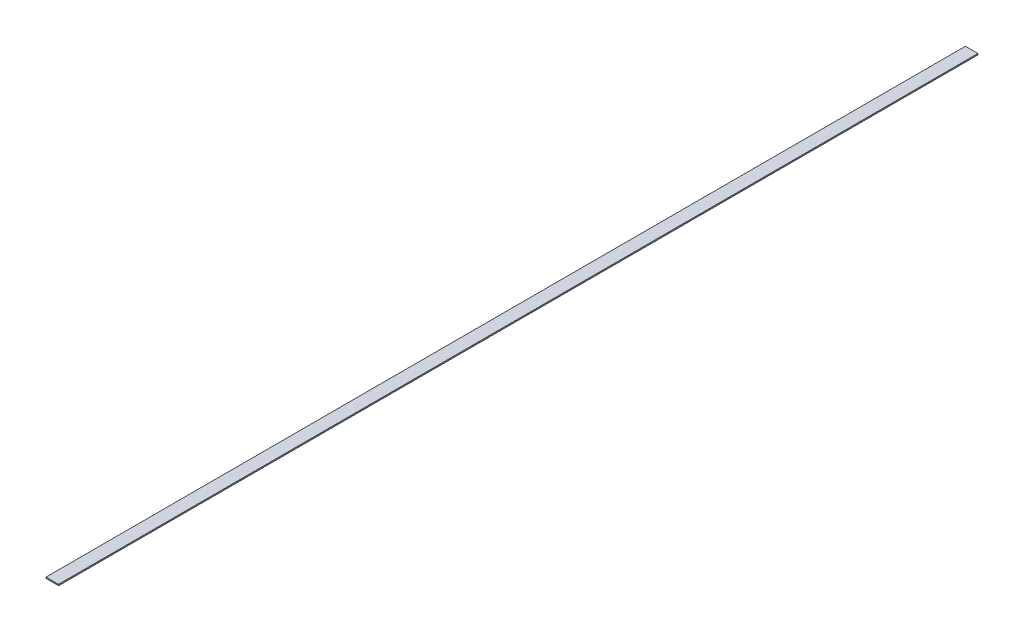
ISO-10303-21;
HEADER;
FILE_DESCRIPTION(('STEP AP214'),'2;1');
FILE_NAME('part.step','',(''),(''),'','','');
FILE_SCHEMA(('AUTOMOTIVE_DESIGN { 1 0 10303 214 1 1 1 1 }'));
ENDSEC;
DATA;
#1=APPLICATION_CONTEXT('core data for automotive mechanical design processes');
#2=APPLICATION_PROTOCOL_DEFINITION('international standard','automotive_design',2000,#1);
#3=PRODUCT_CONTEXT('',#1,'mechanical');
#4=PRODUCT('Part','Part','',(#3));
#5=PRODUCT_RELATED_PRODUCT_CATEGORY('part','',(#4));
#6=PRODUCT_DEFINITION_FORMATION('','',#4);
#7=PRODUCT_DEFINITION_CONTEXT('part definition',#1,'design');
#8=PRODUCT_DEFINITION('design','',#6,#7);
#9=PRODUCT_DEFINITION_SHAPE('','',#8);
#10=(LENGTH_UNIT() NAMED_UNIT(*) SI_UNIT(.MILLI.,.METRE.));
#11=(NAMED_UNIT(*) PLANE_ANGLE_UNIT() SI_UNIT($,.RADIAN.));
#12=(NAMED_UNIT(*) SI_UNIT($,.STERADIAN.) SOLID_ANGLE_UNIT());
#13=UNCERTAINTY_MEASURE_WITH_UNIT(LENGTH_MEASURE(1.E-05),#10,'distance_accuracy_value','');
#14=(GEOMETRIC_REPRESENTATION_CONTEXT(3) GLOBAL_UNCERTAINTY_ASSIGNED_CONTEXT((#13)) GLOBAL_UNIT_ASSIGNED_CONTEXT((#10,
#11,#12)) REPRESENTATION_CONTEXT('',''));
#15=CARTESIAN_POINT('',(0.,0.,0.));
#16=DIRECTION('',(0.,0.,1.));
#17=DIRECTION('',(1.,0.,0.));
#18=AXIS2_PLACEMENT_3D('',#15,#16,#17);
#19=CARTESIAN_POINT('',(-50.7999999999998,5.08,0.));
#20=DIRECTION('',(0.,0.,-1.));
#21=DIRECTION('',(-1.,0.,0.));
#22=AXIS2_PLACEMENT_3D('',#19,#20,#21);
#23=PLANE('',#22);
#24=DIRECTION('',(1.,0.,0.));
#25=VECTOR('',#24,1.);
#26=CARTESIAN_POINT('',(-50.7999999999998,0.,0.));
#27=LINE('',#26,#25);
#28=CARTESIAN_POINT('',(-50.7999999999998,0.,0.));
#29=VERTEX_POINT('',#28);
#30=CARTESIAN_POINT('',(0.,0.,0.));
#31=VERTEX_POINT('',#30);
#32=EDGE_CURVE('E110',#29,#31,#27,.T.);
#33=ORIENTED_EDGE('',*,*,#32,.T.);
#34=DIRECTION('',(0.,-1.,0.));
#35=VECTOR('',#34,1.);
#36=CARTESIAN_POINT('',(0.,5.08,0.));
#37=LINE('',#36,#35);
#38=CARTESIAN_POINT('',(0.,5.08,0.));
#39=VERTEX_POINT('',#38);
#40=EDGE_CURVE('E11',#39,#31,#37,.T.);
#41=ORIENTED_EDGE('',*,*,#40,.F.);
#42=DIRECTION('',(1.,0.,0.));
#43=VECTOR('',#42,1.);
#44=CARTESIAN_POINT('',(-50.7999999999998,5.08,0.));
#45=LINE('',#44,#43);
#46=CARTESIAN_POINT('',(-50.7999999999998,5.08,0.));
#47=VERTEX_POINT('',#46);
#48=EDGE_CURVE('E93',#47,#39,#45,.T.);
#49=ORIENTED_EDGE('',*,*,#48,.F.);
#50=DIRECTION('',(0.,-1.,0.));
#51=VECTOR('',#50,1.);
#52=CARTESIAN_POINT('',(-50.7999999999998,5.08,0.));
#53=LINE('',#52,#51);
#54=EDGE_CURVE('E106',#47,#29,#53,.T.);
#55=ORIENTED_EDGE('',*,*,#54,.T.);
#56=EDGE_LOOP('',(#33,#41,#49,#55));
#57=FACE_BOUND('',#56,.T.);
#58=ADVANCED_FACE('F41',(#57),#23,.F.);
#59=CARTESIAN_POINT('',(0.,5.08,0.));
#60=DIRECTION('',(-1.,0.,0.));
#61=DIRECTION('',(0.,0.,1.));
#62=AXIS2_PLACEMENT_3D('',#59,#60,#61);
#63=PLANE('',#62);
#64=DIRECTION('',(0.,0.,-1.));
#65=VECTOR('',#64,1.);
#66=CARTESIAN_POINT('',(0.,0.,0.));
#67=LINE('',#66,#65);
#68=CARTESIAN_POINT('',(0.,0.,-3721.1));
#69=VERTEX_POINT('',#68);
#70=EDGE_CURVE('E98',#31,#69,#67,.T.);
#71=ORIENTED_EDGE('',*,*,#70,.T.);
#72=DIRECTION('',(0.,-1.,0.));
#73=VECTOR('',#72,1.);
#74=CARTESIAN_POINT('',(0.,5.08,-3721.1));
#75=LINE('',#74,#73);
#76=CARTESIAN_POINT('',(0.,5.08,-3721.1));
#77=VERTEX_POINT('',#76);
#78=EDGE_CURVE('E50',#77,#69,#75,.T.);
#79=ORIENTED_EDGE('',*,*,#78,.F.);
#80=DIRECTION('',(0.,0.,-1.));
#81=VECTOR('',#80,1.);
#82=CARTESIAN_POINT('',(0.,5.08,0.));
#83=LINE('',#82,#81);
#84=EDGE_CURVE('E88',#39,#77,#83,.T.);
#85=ORIENTED_EDGE('',*,*,#84,.F.);
#86=ORIENTED_EDGE('',*,*,#40,.T.);
#87=EDGE_LOOP('',(#71,#79,#85,#86));
#88=FACE_BOUND('',#87,.T.);
#89=ADVANCED_FACE('F97',(#88),#63,.F.);
#90=CARTESIAN_POINT('',(0.,5.08,-3721.1));
#91=DIRECTION('',(0.,0.,1.));
#92=DIRECTION('',(1.,0.,0.));
#93=AXIS2_PLACEMENT_3D('',#90,#91,#92);
#94=PLANE('',#93);
#95=DIRECTION('',(-1.,0.,0.));
#96=VECTOR('',#95,1.);
#97=CARTESIAN_POINT('',(0.,0.,-3721.1));
#98=LINE('',#97,#96);
#99=CARTESIAN_POINT('',(-50.8,0.,-3721.1));
#100=VERTEX_POINT('',#99);
#101=EDGE_CURVE('E75',#69,#100,#98,.T.);
#102=ORIENTED_EDGE('',*,*,#101,.T.);
#103=DIRECTION('',(0.,-1.,0.));
#104=VECTOR('',#103,1.);
#105=CARTESIAN_POINT('',(-50.8,5.08,-3721.1));
#106=LINE('',#105,#104);
#107=CARTESIAN_POINT('',(-50.8,5.08,-3721.1));
#108=VERTEX_POINT('',#107);
#109=EDGE_CURVE('E100',#108,#100,#106,.T.);
#110=ORIENTED_EDGE('',*,*,#109,.F.);
#111=DIRECTION('',(-1.,0.,0.));
#112=VECTOR('',#111,1.);
#113=CARTESIAN_POINT('',(0.,5.08,-3721.1));
#114=LINE('',#113,#112);
#115=EDGE_CURVE('E91',#77,#108,#114,.T.);
#116=ORIENTED_EDGE('',*,*,#115,.F.);
#117=ORIENTED_EDGE('',*,*,#78,.T.);
#118=EDGE_LOOP('',(#102,#110,#116,#117));
#119=FACE_BOUND('',#118,.T.);
#120=ADVANCED_FACE('F101',(#119),#94,.F.);
#121=CARTESIAN_POINT('',(-50.8,5.08,-3721.1));
#122=DIRECTION('',(1.,0.,0.));
#123=DIRECTION('',(0.,0.,-1.));
#124=AXIS2_PLACEMENT_3D('',#121,#122,#123);
#125=PLANE('',#124);
#126=DIRECTION('',(0.,0.,1.));
#127=VECTOR('',#126,1.);
#128=CARTESIAN_POINT('',(-50.8,0.,-3721.1));
#129=LINE('',#128,#127);
#130=EDGE_CURVE('E81',#100,#29,#129,.T.);
#131=ORIENTED_EDGE('',*,*,#130,.T.);
#132=ORIENTED_EDGE('',*,*,#54,.F.);
#133=DIRECTION('',(0.,0.,1.));
#134=VECTOR('',#133,1.);
#135=CARTESIAN_POINT('',(-50.8,5.08,-3721.1));
#136=LINE('',#135,#134);
#137=EDGE_CURVE('E58',#108,#47,#136,.T.);
#138=ORIENTED_EDGE('',*,*,#137,.F.);
#139=ORIENTED_EDGE('',*,*,#109,.T.);
#140=EDGE_LOOP('',(#131,#132,#138,#139));
#141=FACE_BOUND('',#140,.T.);
#142=ADVANCED_FACE('F123',(#141),#125,.F.);
#143=CARTESIAN_POINT('',(0.,5.08,0.));
#144=DIRECTION('',(0.,1.,0.));
#145=DIRECTION('',(0.,0.,1.));
#146=AXIS2_PLACEMENT_3D('',#143,#144,#145);
#147=PLANE('',#146);
#148=ORIENTED_EDGE('',*,*,#48,.T.);
#149=ORIENTED_EDGE('',*,*,#84,.T.);
#150=ORIENTED_EDGE('',*,*,#115,.T.);
#151=ORIENTED_EDGE('',*,*,#137,.T.);
#152=EDGE_LOOP('',(#148,#149,#150,#151));
#153=FACE_BOUND('',#152,.T.);
#154=ADVANCED_FACE('F89',(#153),#147,.T.);
#155=CARTESIAN_POINT('',(0.,0.,0.));
#156=DIRECTION('',(0.,1.,0.));
#157=DIRECTION('',(0.,0.,1.));
#158=AXIS2_PLACEMENT_3D('',#155,#156,#157);
#159=PLANE('',#158);
#160=ORIENTED_EDGE('',*,*,#32,.F.);
#161=ORIENTED_EDGE('',*,*,#130,.F.);
#162=ORIENTED_EDGE('',*,*,#101,.F.);
#163=ORIENTED_EDGE('',*,*,#70,.F.);
#164=EDGE_LOOP('',(#160,#161,#162,#163));
#165=FACE_BOUND('',#164,.T.);
#166=ADVANCED_FACE('F126',(#165),#159,.F.);
#167=CLOSED_SHELL('',(#58,#89,#120,#142,#154,#166));
#168=MANIFOLD_SOLID_BREP('B2',#167);
#169=ADVANCED_BREP_SHAPE_REPRESENTATION('',(#18,#168),#14);
#170=SHAPE_DEFINITION_REPRESENTATION(#9,#169);
ENDSEC;
END-ISO-10303-21;
